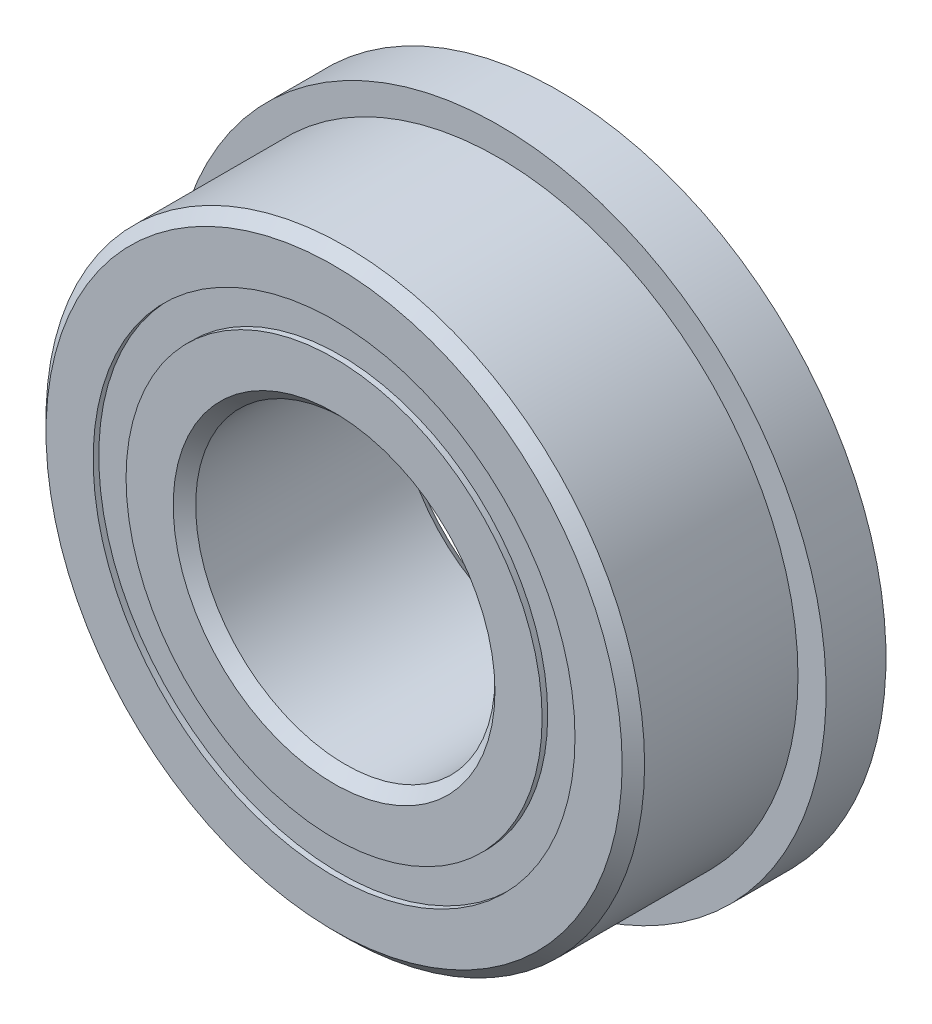
ISO-10303-21;
HEADER;
FILE_DESCRIPTION(('STEP AP214'),'2;1');
FILE_NAME('part.step','',(''),(''),'','','');
FILE_SCHEMA(('AUTOMOTIVE_DESIGN { 1 0 10303 214 1 1 1 1 }'));
ENDSEC;
DATA;
#1=APPLICATION_CONTEXT('core data for automotive mechanical design processes');
#2=APPLICATION_PROTOCOL_DEFINITION('international standard','automotive_design',2000,#1);
#3=PRODUCT_CONTEXT('',#1,'mechanical');
#4=PRODUCT('Part','Part','',(#3));
#5=PRODUCT_RELATED_PRODUCT_CATEGORY('part','',(#4));
#6=PRODUCT_DEFINITION_FORMATION('','',#4);
#7=PRODUCT_DEFINITION_CONTEXT('part definition',#1,'design');
#8=PRODUCT_DEFINITION('design','',#6,#7);
#9=PRODUCT_DEFINITION_SHAPE('','',#8);
#10=(LENGTH_UNIT() NAMED_UNIT(*) SI_UNIT(.MILLI.,.METRE.));
#11=(NAMED_UNIT(*) PLANE_ANGLE_UNIT() SI_UNIT($,.RADIAN.));
#12=(NAMED_UNIT(*) SI_UNIT($,.STERADIAN.) SOLID_ANGLE_UNIT());
#13=UNCERTAINTY_MEASURE_WITH_UNIT(LENGTH_MEASURE(1.E-05),#10,'distance_accuracy_value','');
#14=(GEOMETRIC_REPRESENTATION_CONTEXT(3) GLOBAL_UNCERTAINTY_ASSIGNED_CONTEXT((#13)) GLOBAL_UNIT_ASSIGNED_CONTEXT((#10,
#11,#12)) REPRESENTATION_CONTEXT('',''));
#15=CARTESIAN_POINT('',(0.,0.,0.));
#16=DIRECTION('',(0.,0.,1.));
#17=DIRECTION('',(1.,0.,0.));
#18=AXIS2_PLACEMENT_3D('',#15,#16,#17);
#19=CARTESIAN_POINT('',(0.,5.1114010989011,-2.2621875));
#20=DIRECTION('',(0.,0.,1.));
#21=DIRECTION('',(1.,0.,0.));
#22=AXIS2_PLACEMENT_3D('',#19,#20,#21);
#23=PLANE('',#22);
#24=CARTESIAN_POINT('',(0.,0.,-2.2621875));
#25=DIRECTION('',(0.,0.,1.));
#26=DIRECTION('',(1.,0.,0.));
#27=AXIS2_PLACEMENT_3D('',#24,#25,#26);
#28=CIRCLE('',#27,5.1114010989011);
#29=CARTESIAN_POINT('',(5.1114010989011,0.,-2.2621875));
#30=VERTEX_POINT('',#29);
#31=EDGE_CURVE('E70',#30,#30,#28,.T.);
#32=ORIENTED_EDGE('',*,*,#31,.F.);
#33=EDGE_LOOP('',(#32));
#34=FACE_BOUND('',#33,.T.);
#35=CARTESIAN_POINT('',(0.,0.,-2.2621875));
#36=DIRECTION('',(0.,0.,1.));
#37=DIRECTION('',(1.,0.,0.));
#38=AXIS2_PLACEMENT_3D('',#35,#36,#37);
#39=CIRCLE('',#38,4.4135989010989);
#40=CARTESIAN_POINT('',(4.4135989010989,0.,-2.2621875));
#41=VERTEX_POINT('',#40);
#42=EDGE_CURVE('E11',#41,#41,#39,.T.);
#43=ORIENTED_EDGE('',*,*,#42,.T.);
#44=EDGE_LOOP('',(#43));
#45=FACE_BOUND('',#44,.T.);
#46=ADVANCED_FACE('F56',(#34,#45),#23,.F.);
#47=CARTESIAN_POINT('',(0.,0.,2.38125));
#48=DIRECTION('',(0.,0.,1.));
#49=DIRECTION('',(1.,0.,0.));
#50=AXIS2_PLACEMENT_3D('',#47,#48,#49);
#51=CYLINDRICAL_SURFACE('',#50,4.4135989010989);
#52=ORIENTED_EDGE('',*,*,#42,.F.);
#53=EDGE_LOOP('',(#52));
#54=FACE_BOUND('',#53,.T.);
#55=CARTESIAN_POINT('',(0.,0.,-1.11436144103197));
#56=DIRECTION('',(0.,0.,1.));
#57=DIRECTION('',(1.,0.,0.));
#58=AXIS2_PLACEMENT_3D('',#55,#56,#57);
#59=CIRCLE('',#58,4.4135989010989);
#60=CARTESIAN_POINT('',(4.4135989010989,0.,-1.11436144103197));
#61=VERTEX_POINT('',#60);
#62=EDGE_CURVE('E62',#61,#61,#59,.T.);
#63=ORIENTED_EDGE('',*,*,#62,.T.);
#64=EDGE_LOOP('',(#63));
#65=FACE_BOUND('',#64,.T.);
#66=ADVANCED_FACE('F79',(#54,#65),#51,.F.);
#67=CARTESIAN_POINT('',(0.,5.1114010989011,-1.11436144103197));
#68=DIRECTION('',(0.,0.,-1.));
#69=DIRECTION('',(-1.,0.,0.));
#70=AXIS2_PLACEMENT_3D('',#67,#68,#69);
#71=PLANE('',#70);
#72=ORIENTED_EDGE('',*,*,#62,.F.);
#73=EDGE_LOOP('',(#72));
#74=FACE_BOUND('',#73,.T.);
#75=CARTESIAN_POINT('',(0.,0.,-1.11436144103197));
#76=DIRECTION('',(0.,0.,1.));
#77=DIRECTION('',(1.,0.,0.));
#78=AXIS2_PLACEMENT_3D('',#75,#76,#77);
#79=CIRCLE('',#78,5.1114010989011);
#80=CARTESIAN_POINT('',(5.1114010989011,0.,-1.11436144103197));
#81=VERTEX_POINT('',#80);
#82=EDGE_CURVE('E66',#81,#81,#79,.T.);
#83=ORIENTED_EDGE('',*,*,#82,.T.);
#84=EDGE_LOOP('',(#83));
#85=FACE_BOUND('',#84,.T.);
#86=ADVANCED_FACE('F83',(#74,#85),#71,.F.);
#87=CARTESIAN_POINT('',(0.,0.,2.38125));
#88=DIRECTION('',(0.,0.,1.));
#89=DIRECTION('',(1.,0.,0.));
#90=AXIS2_PLACEMENT_3D('',#87,#88,#89);
#91=CYLINDRICAL_SURFACE('',#90,5.1114010989011);
#92=ORIENTED_EDGE('',*,*,#82,.F.);
#93=EDGE_LOOP('',(#92));
#94=FACE_BOUND('',#93,.T.);
#95=ORIENTED_EDGE('',*,*,#31,.T.);
#96=EDGE_LOOP('',(#95));
#97=FACE_BOUND('',#96,.T.);
#98=ADVANCED_FACE('F76',(#94,#97),#91,.T.);
#99=CLOSED_SHELL('',(#46,#66,#86,#98));
#100=MANIFOLD_SOLID_BREP('B2',#99);
#101=CARTESIAN_POINT('',(0.,5.1114010989011,2.2621875));
#102=DIRECTION('',(0.,0.,-1.));
#103=DIRECTION('',(-1.,0.,0.));
#104=AXIS2_PLACEMENT_3D('',#101,#102,#103);
#105=PLANE('',#104);
#106=CARTESIAN_POINT('',(0.,0.,2.2621875));
#107=DIRECTION('',(0.,0.,1.));
#108=DIRECTION('',(1.,0.,0.));
#109=AXIS2_PLACEMENT_3D('',#106,#107,#108);
#110=CIRCLE('',#109,4.4135989010989);
#111=CARTESIAN_POINT('',(4.4135989010989,0.,2.2621875));
#112=VERTEX_POINT('',#111);
#113=EDGE_CURVE('E55',#112,#112,#110,.T.);
#114=ORIENTED_EDGE('',*,*,#113,.F.);
#115=EDGE_LOOP('',(#114));
#116=FACE_BOUND('',#115,.T.);
#117=CARTESIAN_POINT('',(0.,0.,2.2621875));
#118=DIRECTION('',(0.,0.,1.));
#119=DIRECTION('',(1.,0.,0.));
#120=AXIS2_PLACEMENT_3D('',#117,#118,#119);
#121=CIRCLE('',#120,5.1114010989011);
#122=CARTESIAN_POINT('',(5.1114010989011,0.,2.2621875));
#123=VERTEX_POINT('',#122);
#124=EDGE_CURVE('E130',#123,#123,#121,.T.);
#125=ORIENTED_EDGE('',*,*,#124,.T.);
#126=EDGE_LOOP('',(#125));
#127=FACE_BOUND('',#126,.T.);
#128=ADVANCED_FACE('F116',(#116,#127),#105,.F.);
#129=CARTESIAN_POINT('',(0.,0.,2.38125));
#130=DIRECTION('',(0.,0.,1.));
#131=DIRECTION('',(1.,0.,0.));
#132=AXIS2_PLACEMENT_3D('',#129,#130,#131);
#133=CYLINDRICAL_SURFACE('',#132,4.4135989010989);
#134=CARTESIAN_POINT('',(0.,0.,1.11436144103197));
#135=DIRECTION('',(0.,0.,1.));
#136=DIRECTION('',(1.,0.,0.));
#137=AXIS2_PLACEMENT_3D('',#134,#135,#136);
#138=CIRCLE('',#137,4.4135989010989);
#139=CARTESIAN_POINT('',(4.4135989010989,0.,1.11436144103197));
#140=VERTEX_POINT('',#139);
#141=EDGE_CURVE('E122',#140,#140,#138,.T.);
#142=ORIENTED_EDGE('',*,*,#141,.F.);
#143=EDGE_LOOP('',(#142));
#144=FACE_BOUND('',#143,.T.);
#145=ORIENTED_EDGE('',*,*,#113,.T.);
#146=EDGE_LOOP('',(#145));
#147=FACE_BOUND('',#146,.T.);
#148=ADVANCED_FACE('F145',(#144,#147),#133,.F.);
#149=CARTESIAN_POINT('',(0.,5.1114010989011,1.11436144103197));
#150=DIRECTION('',(0.,0.,1.));
#151=DIRECTION('',(1.,0.,0.));
#152=AXIS2_PLACEMENT_3D('',#149,#150,#151);
#153=PLANE('',#152);
#154=CARTESIAN_POINT('',(0.,0.,1.11436144103197));
#155=DIRECTION('',(0.,0.,1.));
#156=DIRECTION('',(1.,0.,0.));
#157=AXIS2_PLACEMENT_3D('',#154,#155,#156);
#158=CIRCLE('',#157,5.1114010989011);
#159=CARTESIAN_POINT('',(5.1114010989011,0.,1.11436144103197));
#160=VERTEX_POINT('',#159);
#161=EDGE_CURVE('E126',#160,#160,#158,.T.);
#162=ORIENTED_EDGE('',*,*,#161,.F.);
#163=EDGE_LOOP('',(#162));
#164=FACE_BOUND('',#163,.T.);
#165=ORIENTED_EDGE('',*,*,#141,.T.);
#166=EDGE_LOOP('',(#165));
#167=FACE_BOUND('',#166,.T.);
#168=ADVANCED_FACE('F140',(#164,#167),#153,.F.);
#169=CARTESIAN_POINT('',(0.,0.,2.38125));
#170=DIRECTION('',(0.,0.,1.));
#171=DIRECTION('',(1.,0.,0.));
#172=AXIS2_PLACEMENT_3D('',#169,#170,#171);
#173=CYLINDRICAL_SURFACE('',#172,5.1114010989011);
#174=ORIENTED_EDGE('',*,*,#124,.F.);
#175=EDGE_LOOP('',(#174));
#176=FACE_BOUND('',#175,.T.);
#177=ORIENTED_EDGE('',*,*,#161,.T.);
#178=EDGE_LOOP('',(#177));
#179=FACE_BOUND('',#178,.T.);
#180=ADVANCED_FACE('F137',(#176,#179),#173,.T.);
#181=CLOSED_SHELL('',(#128,#148,#168,#180));
#182=MANIFOLD_SOLID_BREP('B6',#181);
#183=CARTESIAN_POINT('',(-2.38124999999995,4.12444598552342,0.));
#184=DIRECTION('',(0.,0.,1.));
#185=DIRECTION('',(-0.499999999999989,0.866025403784445,0.));
#186=AXIS2_PLACEMENT_3D('',#183,#184,#185);
#187=SPHERICAL_SURFACE('',#186,1.11436144103197);
#188=CARTESIAN_POINT('',(-2.38124999999995,4.12444598552342,1.11436144103197));
#189=VERTEX_POINT('',#188);
#190=VERTEX_LOOP('',#189);
#191=FACE_BOUND('',#190,.T.);
#192=ADVANCED_FACE('F176',(#191),#187,.T.);
#193=CLOSED_SHELL('',(#192));
#194=MANIFOLD_SOLID_BREP('B50',#193);
#195=CARTESIAN_POINT('',(-4.12444598552336,2.38125000000005,0.));
#196=DIRECTION('',(0.,0.,1.));
#197=DIRECTION('',(-0.866025403784433,0.50000000000001,0.));
#198=AXIS2_PLACEMENT_3D('',#195,#196,#197);
#199=SPHERICAL_SURFACE('',#198,1.11436144103197);
#200=CARTESIAN_POINT('',(-4.12444598552336,2.38125000000005,1.11436144103197));
#201=VERTEX_POINT('',#200);
#202=VERTEX_LOOP('',#201);
#203=FACE_BOUND('',#202,.T.);
#204=ADVANCED_FACE('F199',(#203),#199,.T.);
#205=CLOSED_SHELL('',(#204));
#206=MANIFOLD_SOLID_BREP('B112',#205);
#207=CARTESIAN_POINT('',(-4.7625,0.,0.));
#208=DIRECTION('',(0.,0.,1.));
#209=DIRECTION('',(-1.,0.,0.));
#210=AXIS2_PLACEMENT_3D('',#207,#208,#209);
#211=SPHERICAL_SURFACE('',#210,1.11436144103197);
#212=CARTESIAN_POINT('',(-4.7625,0.,1.11436144103197));
#213=VERTEX_POINT('',#212);
#214=VERTEX_LOOP('',#213);
#215=FACE_BOUND('',#214,.T.);
#216=ADVANCED_FACE('F222',(#215),#211,.T.);
#217=CLOSED_SHELL('',(#216));
#218=MANIFOLD_SOLID_BREP('B172',#217);
#219=CARTESIAN_POINT('',(-4.12444598552341,-2.38124999999996,0.));
#220=DIRECTION('',(0.,0.,1.));
#221=DIRECTION('',(-0.866025403784443,-0.499999999999992,0.));
#222=AXIS2_PLACEMENT_3D('',#219,#220,#221);
#223=SPHERICAL_SURFACE('',#222,1.11436144103197);
#224=CARTESIAN_POINT('',(-4.12444598552341,-2.38124999999996,1.11436144103197));
#225=VERTEX_POINT('',#224);
#226=VERTEX_LOOP('',#225);
#227=FACE_BOUND('',#226,.T.);
#228=ADVANCED_FACE('F245',(#227),#223,.T.);
#229=CLOSED_SHELL('',(#228));
#230=MANIFOLD_SOLID_BREP('B195',#229);
#231=CARTESIAN_POINT('',(-2.38125000000003,-4.12444598552337,0.));
#232=DIRECTION('',(0.,0.,1.));
#233=DIRECTION('',(-0.500000000000007,-0.866025403784435,0.));
#234=AXIS2_PLACEMENT_3D('',#231,#232,#233);
#235=SPHERICAL_SURFACE('',#234,1.11436144103197);
#236=CARTESIAN_POINT('',(-2.38125000000003,-4.12444598552337,1.11436144103197));
#237=VERTEX_POINT('',#236);
#238=VERTEX_LOOP('',#237);
#239=FACE_BOUND('',#238,.T.);
#240=ADVANCED_FACE('F268',(#239),#235,.T.);
#241=CLOSED_SHELL('',(#240));
#242=MANIFOLD_SOLID_BREP('B218',#241);
#243=CARTESIAN_POINT('',(0.,-4.7625,0.));
#244=DIRECTION('',(0.,0.,1.));
#245=DIRECTION('',(0.,-1.,0.));
#246=AXIS2_PLACEMENT_3D('',#243,#244,#245);
#247=SPHERICAL_SURFACE('',#246,1.11436144103197);
#248=CARTESIAN_POINT('',(0.,-4.7625,1.11436144103197));
#249=VERTEX_POINT('',#248);
#250=VERTEX_LOOP('',#249);
#251=FACE_BOUND('',#250,.T.);
#252=ADVANCED_FACE('F291',(#251),#247,.T.);
#253=CLOSED_SHELL('',(#252));
#254=MANIFOLD_SOLID_BREP('B241',#253);
#255=CARTESIAN_POINT('',(2.38124999999998,-4.1244459855234,0.));
#256=DIRECTION('',(0.,0.,1.));
#257=DIRECTION('',(0.499999999999995,-0.866025403784442,0.));
#258=AXIS2_PLACEMENT_3D('',#255,#256,#257);
#259=SPHERICAL_SURFACE('',#258,1.11436144103197);
#260=CARTESIAN_POINT('',(2.38124999999998,-4.1244459855234,1.11436144103197));
#261=VERTEX_POINT('',#260);
#262=VERTEX_LOOP('',#261);
#263=FACE_BOUND('',#262,.T.);
#264=ADVANCED_FACE('F314',(#263),#259,.T.);
#265=CLOSED_SHELL('',(#264));
#266=MANIFOLD_SOLID_BREP('B264',#265);
#267=CARTESIAN_POINT('',(4.12444598552338,-2.38125000000002,0.));
#268=DIRECTION('',(0.,0.,1.));
#269=DIRECTION('',(0.866025403784436,-0.500000000000004,0.));
#270=AXIS2_PLACEMENT_3D('',#267,#268,#269);
#271=SPHERICAL_SURFACE('',#270,1.11436144103197);
#272=CARTESIAN_POINT('',(4.12444598552338,-2.38125000000002,1.11436144103197));
#273=VERTEX_POINT('',#272);
#274=VERTEX_LOOP('',#273);
#275=FACE_BOUND('',#274,.T.);
#276=ADVANCED_FACE('F337',(#275),#271,.T.);
#277=CLOSED_SHELL('',(#276));
#278=MANIFOLD_SOLID_BREP('B287',#277);
#279=CARTESIAN_POINT('',(4.7625,0.,0.));
#280=DIRECTION('',(0.,0.,1.));
#281=DIRECTION('',(1.,0.,0.));
#282=AXIS2_PLACEMENT_3D('',#279,#280,#281);
#283=SPHERICAL_SURFACE('',#282,1.11436144103197);
#284=CARTESIAN_POINT('',(4.7625,0.,1.11436144103197));
#285=VERTEX_POINT('',#284);
#286=VERTEX_LOOP('',#285);
#287=FACE_BOUND('',#286,.T.);
#288=ADVANCED_FACE('F360',(#287),#283,.T.);
#289=CLOSED_SHELL('',(#288));
#290=MANIFOLD_SOLID_BREP('B310',#289);
#291=CARTESIAN_POINT('',(4.12444598552339,2.38124999999999,0.));
#292=DIRECTION('',(0.,0.,1.));
#293=DIRECTION('',(0.86602540378444,0.499999999999998,0.));
#294=AXIS2_PLACEMENT_3D('',#291,#292,#293);
#295=SPHERICAL_SURFACE('',#294,1.11436144103197);
#296=CARTESIAN_POINT('',(4.12444598552339,2.38124999999999,1.11436144103197));
#297=VERTEX_POINT('',#296);
#298=VERTEX_LOOP('',#297);
#299=FACE_BOUND('',#298,.T.);
#300=ADVANCED_FACE('F383',(#299),#295,.T.);
#301=CLOSED_SHELL('',(#300));
#302=MANIFOLD_SOLID_BREP('B333',#301);
#303=CARTESIAN_POINT('',(2.38125,4.12444598552339,0.));
#304=DIRECTION('',(0.,0.,1.));
#305=DIRECTION('',(0.500000000000001,0.866025403784438,0.));
#306=AXIS2_PLACEMENT_3D('',#303,#304,#305);
#307=SPHERICAL_SURFACE('',#306,1.11436144103197);
#308=CARTESIAN_POINT('',(2.38125,4.12444598552339,1.11436144103197));
#309=VERTEX_POINT('',#308);
#310=VERTEX_LOOP('',#309);
#311=FACE_BOUND('',#310,.T.);
#312=ADVANCED_FACE('F406',(#311),#307,.T.);
#313=CLOSED_SHELL('',(#312));
#314=MANIFOLD_SOLID_BREP('B356',#313);
#315=CARTESIAN_POINT('',(0.,4.7625,0.));
#316=DIRECTION('',(0.,0.,1.));
#317=DIRECTION('',(0.,1.,0.));
#318=AXIS2_PLACEMENT_3D('',#315,#316,#317);
#319=SPHERICAL_SURFACE('',#318,1.11436144103197);
#320=CARTESIAN_POINT('',(0.,4.7625,1.11436144103197));
#321=VERTEX_POINT('',#320);
#322=VERTEX_LOOP('',#321);
#323=FACE_BOUND('',#322,.T.);
#324=ADVANCED_FACE('F431',(#323),#319,.T.);
#325=CLOSED_SHELL('',(#324));
#326=MANIFOLD_SOLID_BREP('B379',#325);
#327=CARTESIAN_POINT('',(0.,4.4135989010989,2.38125));
#328=DIRECTION('',(0.,0.,-1.));
#329=DIRECTION('',(-1.,0.,0.));
#330=AXIS2_PLACEMENT_3D('',#327,#328,#329);
#331=PLANE('',#330);
#332=CARTESIAN_POINT('',(0.,0.,2.38125));
#333=DIRECTION('',(0.,0.,1.));
#334=DIRECTION('',(1.,0.,0.));
#335=AXIS2_PLACEMENT_3D('',#332,#333,#334);
#336=CIRCLE('',#335,3.413125);
#337=CARTESIAN_POINT('',(3.413125,0.,2.38125));
#338=VERTEX_POINT('',#337);
#339=EDGE_CURVE('E477',#338,#338,#336,.T.);
#340=ORIENTED_EDGE('',*,*,#339,.F.);
#341=EDGE_LOOP('',(#340));
#342=FACE_BOUND('',#341,.T.);
#343=CARTESIAN_POINT('',(0.,0.,2.38125));
#344=DIRECTION('',(0.,0.,1.));
#345=DIRECTION('',(1.,0.,0.));
#346=AXIS2_PLACEMENT_3D('',#343,#344,#345);
#347=CIRCLE('',#346,4.4135989010989);
#348=CARTESIAN_POINT('',(4.4135989010989,0.,2.38125));
#349=VERTEX_POINT('',#348);
#350=EDGE_CURVE('E430',#349,#349,#347,.T.);
#351=ORIENTED_EDGE('',*,*,#350,.T.);
#352=EDGE_LOOP('',(#351));
#353=FACE_BOUND('',#352,.T.);
#354=ADVANCED_FACE('F449',(#342,#353),#331,.F.);
#355=CARTESIAN_POINT('',(0.,0.,2.38125));
#356=DIRECTION('',(0.,0.,1.));
#357=DIRECTION('',(1.,0.,0.));
#358=AXIS2_PLACEMENT_3D('',#355,#356,#357);
#359=CYLINDRICAL_SURFACE('',#358,4.4135989010989);
#360=ORIENTED_EDGE('',*,*,#350,.F.);
#361=EDGE_LOOP('',(#360));
#362=FACE_BOUND('',#361,.T.);
#363=CARTESIAN_POINT('',(0.,0.,1.05833333333333));
#364=DIRECTION('',(0.,0.,1.));
#365=DIRECTION('',(1.,0.,0.));
#366=AXIS2_PLACEMENT_3D('',#363,#364,#365);
#367=CIRCLE('',#366,4.4135989010989);
#368=CARTESIAN_POINT('',(4.4135989010989,0.,1.05833333333333));
#369=VERTEX_POINT('',#368);
#370=EDGE_CURVE('E455',#369,#369,#367,.T.);
#371=ORIENTED_EDGE('',*,*,#370,.T.);
#372=EDGE_LOOP('',(#371));
#373=FACE_BOUND('',#372,.T.);
#374=ADVANCED_FACE('F484',(#362,#373),#359,.T.);
#375=CARTESIAN_POINT('',(0.,0.,0.));
#376=DIRECTION('',(0.,0.,1.));
#377=DIRECTION('',(1.,0.,0.));
#378=AXIS2_PLACEMENT_3D('',#375,#376,#377);
#379=TOROIDAL_SURFACE('',#378,4.76249999999999,1.11436144103196);
#380=ORIENTED_EDGE('',*,*,#370,.F.);
#381=EDGE_LOOP('',(#380));
#382=FACE_BOUND('',#381,.T.);
#383=CARTESIAN_POINT('',(0.,0.,-1.05833333333333));
#384=DIRECTION('',(0.,0.,1.));
#385=DIRECTION('',(1.,0.,0.));
#386=AXIS2_PLACEMENT_3D('',#383,#384,#385);
#387=CIRCLE('',#386,4.4135989010989);
#388=CARTESIAN_POINT('',(4.4135989010989,0.,-1.05833333333333));
#389=VERTEX_POINT('',#388);
#390=EDGE_CURVE('E459',#389,#389,#387,.T.);
#391=ORIENTED_EDGE('',*,*,#390,.T.);
#392=EDGE_LOOP('',(#391));
#393=FACE_BOUND('',#392,.T.);
#394=ADVANCED_FACE('F488',(#382,#393),#379,.F.);
#395=CARTESIAN_POINT('',(0.,0.,2.38125));
#396=DIRECTION('',(0.,0.,1.));
#397=DIRECTION('',(1.,0.,0.));
#398=AXIS2_PLACEMENT_3D('',#395,#396,#397);
#399=CYLINDRICAL_SURFACE('',#398,4.4135989010989);
#400=ORIENTED_EDGE('',*,*,#390,.F.);
#401=EDGE_LOOP('',(#400));
#402=FACE_BOUND('',#401,.T.);
#403=CARTESIAN_POINT('',(0.,0.,-2.38125));
#404=DIRECTION('',(0.,0.,1.));
#405=DIRECTION('',(1.,0.,0.));
#406=AXIS2_PLACEMENT_3D('',#403,#404,#405);
#407=CIRCLE('',#406,4.4135989010989);
#408=CARTESIAN_POINT('',(4.4135989010989,0.,-2.38125));
#409=VERTEX_POINT('',#408);
#410=EDGE_CURVE('E463',#409,#409,#407,.T.);
#411=ORIENTED_EDGE('',*,*,#410,.T.);
#412=EDGE_LOOP('',(#411));
#413=FACE_BOUND('',#412,.T.);
#414=ADVANCED_FACE('F493',(#402,#413),#399,.T.);
#415=CARTESIAN_POINT('',(0.,3.413125,-2.38125));
#416=DIRECTION('',(0.,0.,1.));
#417=DIRECTION('',(1.,0.,0.));
#418=AXIS2_PLACEMENT_3D('',#415,#416,#417);
#419=PLANE('',#418);
#420=ORIENTED_EDGE('',*,*,#410,.F.);
#421=EDGE_LOOP('',(#420));
#422=FACE_BOUND('',#421,.T.);
#423=CARTESIAN_POINT('',(0.,0.,-2.38125));
#424=DIRECTION('',(0.,0.,1.));
#425=DIRECTION('',(1.,0.,0.));
#426=AXIS2_PLACEMENT_3D('',#423,#424,#425);
#427=CIRCLE('',#426,3.413125);
#428=CARTESIAN_POINT('',(3.413125,0.,-2.38125));
#429=VERTEX_POINT('',#428);
#430=EDGE_CURVE('E468',#429,#429,#427,.T.);
#431=ORIENTED_EDGE('',*,*,#430,.T.);
#432=EDGE_LOOP('',(#431));
#433=FACE_BOUND('',#432,.T.);
#434=ADVANCED_FACE('F499',(#422,#433),#419,.F.);
#435=CARTESIAN_POINT('',(0.,0.,-2.143125));
#436=DIRECTION('',(0.,0.,-1.));
#437=DIRECTION('',(-1.,0.,0.));
#438=AXIS2_PLACEMENT_3D('',#435,#436,#437);
#439=CONICAL_SURFACE('',#438,3.175,0.785398163397447);
#440=ORIENTED_EDGE('',*,*,#430,.F.);
#441=EDGE_LOOP('',(#440));
#442=FACE_BOUND('',#441,.T.);
#443=CARTESIAN_POINT('',(0.,0.,-2.143125));
#444=DIRECTION('',(0.,0.,1.));
#445=DIRECTION('',(1.,0.,0.));
#446=AXIS2_PLACEMENT_3D('',#443,#444,#445);
#447=CIRCLE('',#446,3.175);
#448=CARTESIAN_POINT('',(3.175,0.,-2.143125));
#449=VERTEX_POINT('',#448);
#450=EDGE_CURVE('E471',#449,#449,#447,.T.);
#451=ORIENTED_EDGE('',*,*,#450,.T.);
#452=EDGE_LOOP('',(#451));
#453=FACE_BOUND('',#452,.T.);
#454=ADVANCED_FACE('F503',(#442,#453),#439,.F.);
#455=CARTESIAN_POINT('',(0.,0.,2.38125));
#456=DIRECTION('',(0.,0.,1.));
#457=DIRECTION('',(1.,0.,0.));
#458=AXIS2_PLACEMENT_3D('',#455,#456,#457);
#459=CYLINDRICAL_SURFACE('',#458,3.175);
#460=ORIENTED_EDGE('',*,*,#450,.F.);
#461=EDGE_LOOP('',(#460));
#462=FACE_BOUND('',#461,.T.);
#463=CARTESIAN_POINT('',(0.,0.,2.143125));
#464=DIRECTION('',(0.,0.,1.));
#465=DIRECTION('',(1.,0.,0.));
#466=AXIS2_PLACEMENT_3D('',#463,#464,#465);
#467=CIRCLE('',#466,3.175);
#468=CARTESIAN_POINT('',(3.175,0.,2.143125));
#469=VERTEX_POINT('',#468);
#470=EDGE_CURVE('E474',#469,#469,#467,.T.);
#471=ORIENTED_EDGE('',*,*,#470,.T.);
#472=EDGE_LOOP('',(#471));
#473=FACE_BOUND('',#472,.T.);
#474=ADVANCED_FACE('F507',(#462,#473),#459,.F.);
#475=CARTESIAN_POINT('',(0.,0.,2.38125));
#476=DIRECTION('',(0.,0.,1.));
#477=DIRECTION('',(1.,0.,0.));
#478=AXIS2_PLACEMENT_3D('',#475,#476,#477);
#479=CONICAL_SURFACE('',#478,3.413125,0.785398163397448);
#480=ORIENTED_EDGE('',*,*,#470,.F.);
#481=EDGE_LOOP('',(#480));
#482=FACE_BOUND('',#481,.T.);
#483=ORIENTED_EDGE('',*,*,#339,.T.);
#484=EDGE_LOOP('',(#483));
#485=FACE_BOUND('',#484,.T.);
#486=ADVANCED_FACE('F481',(#482,#485),#479,.F.);
#487=CLOSED_SHELL('',(#354,#374,#394,#414,#434,#454,#474,#486));
#488=MANIFOLD_SOLID_BREP('B402',#487);
#489=CARTESIAN_POINT('',(0.,0.,2.143125));
#490=DIRECTION('',(0.,0.,-1.));
#491=DIRECTION('',(-1.,0.,0.));
#492=AXIS2_PLACEMENT_3D('',#489,#490,#491);
#493=CONICAL_SURFACE('',#492,6.35,0.785398163397449);
#494=CARTESIAN_POINT('',(0.,0.,2.38125));
#495=DIRECTION('',(0.,0.,1.));
#496=DIRECTION('',(1.,0.,0.));
#497=AXIS2_PLACEMENT_3D('',#494,#495,#496);
#498=CIRCLE('',#497,6.111875);
#499=CARTESIAN_POINT('',(6.111875,0.,2.38125));
#500=VERTEX_POINT('',#499);
#501=EDGE_CURVE('E582',#500,#500,#498,.T.);
#502=ORIENTED_EDGE('',*,*,#501,.F.);
#503=EDGE_LOOP('',(#502));
#504=FACE_BOUND('',#503,.T.);
#505=CARTESIAN_POINT('',(0.,0.,2.143125));
#506=DIRECTION('',(0.,0.,1.));
#507=DIRECTION('',(1.,0.,0.));
#508=AXIS2_PLACEMENT_3D('',#505,#506,#507);
#509=CIRCLE('',#508,6.35);
#510=CARTESIAN_POINT('',(6.35,0.,2.143125));
#511=VERTEX_POINT('',#510);
#512=EDGE_CURVE('E448',#511,#511,#509,.T.);
#513=ORIENTED_EDGE('',*,*,#512,.T.);
#514=EDGE_LOOP('',(#513));
#515=FACE_BOUND('',#514,.T.);
#516=ADVANCED_FACE('F555',(#504,#515),#493,.T.);
#517=CARTESIAN_POINT('',(0.,0.,2.38125));
#518=DIRECTION('',(0.,0.,1.));
#519=DIRECTION('',(1.,0.,0.));
#520=AXIS2_PLACEMENT_3D('',#517,#518,#519);
#521=CYLINDRICAL_SURFACE('',#520,6.35);
#522=CARTESIAN_POINT('',(0.,0.,-1.11125));
#523=DIRECTION('',(0.,0.,1.));
#524=DIRECTION('',(1.,0.,0.));
#525=AXIS2_PLACEMENT_3D('',#522,#523,#524);
#526=CIRCLE('',#525,6.35);
#527=CARTESIAN_POINT('',(6.35,0.,-1.11125));
#528=VERTEX_POINT('',#527);
#529=EDGE_CURVE('E586',#528,#528,#526,.T.);
#530=ORIENTED_EDGE('',*,*,#529,.T.);
#531=EDGE_LOOP('',(#530));
#532=FACE_BOUND('',#531,.T.);
#533=ORIENTED_EDGE('',*,*,#512,.F.);
#534=EDGE_LOOP('',(#533));
#535=FACE_BOUND('',#534,.T.);
#536=ADVANCED_FACE('F609',(#532,#535),#521,.T.);
#537=CARTESIAN_POINT('',(0.,6.111875,-2.38125));
#538=DIRECTION('',(0.,0.,1.));
#539=DIRECTION('',(1.,0.,0.));
#540=AXIS2_PLACEMENT_3D('',#537,#538,#539);
#541=PLANE('',#540);
#542=CARTESIAN_POINT('',(0.,0.,-2.38125));
#543=DIRECTION('',(0.,0.,1.));
#544=DIRECTION('',(1.,0.,0.));
#545=AXIS2_PLACEMENT_3D('',#542,#543,#544);
#546=CIRCLE('',#545,5.1114010989011);
#547=CARTESIAN_POINT('',(5.1114010989011,0.,-2.38125));
#548=VERTEX_POINT('',#547);
#549=EDGE_CURVE('E562',#548,#548,#546,.T.);
#550=ORIENTED_EDGE('',*,*,#549,.T.);
#551=EDGE_LOOP('',(#550));
#552=FACE_BOUND('',#551,.T.);
#553=CARTESIAN_POINT('',(0.,0.,-2.38125));
#554=DIRECTION('',(0.,0.,-1.));
#555=DIRECTION('',(-1.,0.,0.));
#556=AXIS2_PLACEMENT_3D('',#553,#554,#555);
#557=CIRCLE('',#556,6.9469);
#558=CARTESIAN_POINT('',(-6.9469,0.,-2.38125));
#559=VERTEX_POINT('',#558);
#560=EDGE_CURVE('E590',#559,#559,#557,.T.);
#561=ORIENTED_EDGE('',*,*,#560,.T.);
#562=EDGE_LOOP('',(#561));
#563=FACE_BOUND('',#562,.T.);
#564=ADVANCED_FACE('F612',(#552,#563),#541,.F.);
#565=CARTESIAN_POINT('',(0.,0.,2.38125));
#566=DIRECTION('',(0.,0.,1.));
#567=DIRECTION('',(1.,0.,0.));
#568=AXIS2_PLACEMENT_3D('',#565,#566,#567);
#569=CYLINDRICAL_SURFACE('',#568,5.1114010989011);
#570=CARTESIAN_POINT('',(0.,0.,-1.05833333333333));
#571=DIRECTION('',(0.,0.,1.));
#572=DIRECTION('',(1.,0.,0.));
#573=AXIS2_PLACEMENT_3D('',#570,#571,#572);
#574=CIRCLE('',#573,5.1114010989011);
#575=CARTESIAN_POINT('',(5.1114010989011,0.,-1.05833333333333));
#576=VERTEX_POINT('',#575);
#577=EDGE_CURVE('E567',#576,#576,#574,.T.);
#578=ORIENTED_EDGE('',*,*,#577,.T.);
#579=EDGE_LOOP('',(#578));
#580=FACE_BOUND('',#579,.T.);
#581=ORIENTED_EDGE('',*,*,#549,.F.);
#582=EDGE_LOOP('',(#581));
#583=FACE_BOUND('',#582,.T.);
#584=ADVANCED_FACE('F617',(#580,#583),#569,.F.);
#585=CARTESIAN_POINT('',(0.,0.,0.));
#586=DIRECTION('',(0.,0.,1.));
#587=DIRECTION('',(1.,0.,0.));
#588=AXIS2_PLACEMENT_3D('',#585,#586,#587);
#589=TOROIDAL_SURFACE('',#588,4.7625,1.11436144103197);
#590=ORIENTED_EDGE('',*,*,#577,.F.);
#591=EDGE_LOOP('',(#590));
#592=FACE_BOUND('',#591,.T.);
#593=CARTESIAN_POINT('',(0.,0.,1.05833333333333));
#594=DIRECTION('',(0.,0.,1.));
#595=DIRECTION('',(1.,0.,0.));
#596=AXIS2_PLACEMENT_3D('',#593,#594,#595);
#597=CIRCLE('',#596,5.1114010989011);
#598=CARTESIAN_POINT('',(5.1114010989011,0.,1.05833333333333));
#599=VERTEX_POINT('',#598);
#600=EDGE_CURVE('E572',#599,#599,#597,.T.);
#601=ORIENTED_EDGE('',*,*,#600,.T.);
#602=EDGE_LOOP('',(#601));
#603=FACE_BOUND('',#602,.T.);
#604=ADVANCED_FACE('F624',(#592,#603),#589,.F.);
#605=CARTESIAN_POINT('',(0.,0.,2.38125));
#606=DIRECTION('',(0.,0.,1.));
#607=DIRECTION('',(1.,0.,0.));
#608=AXIS2_PLACEMENT_3D('',#605,#606,#607);
#609=CYLINDRICAL_SURFACE('',#608,5.1114010989011);
#610=ORIENTED_EDGE('',*,*,#600,.F.);
#611=EDGE_LOOP('',(#610));
#612=FACE_BOUND('',#611,.T.);
#613=CARTESIAN_POINT('',(0.,0.,2.38125));
#614=DIRECTION('',(0.,0.,1.));
#615=DIRECTION('',(1.,0.,0.));
#616=AXIS2_PLACEMENT_3D('',#613,#614,#615);
#617=CIRCLE('',#616,5.1114010989011);
#618=CARTESIAN_POINT('',(5.1114010989011,0.,2.38125));
#619=VERTEX_POINT('',#618);
#620=EDGE_CURVE('E578',#619,#619,#617,.T.);
#621=ORIENTED_EDGE('',*,*,#620,.T.);
#622=EDGE_LOOP('',(#621));
#623=FACE_BOUND('',#622,.T.);
#624=ADVANCED_FACE('F628',(#612,#623),#609,.F.);
#625=CARTESIAN_POINT('',(0.,6.111875,2.38125));
#626=DIRECTION('',(0.,0.,-1.));
#627=DIRECTION('',(-1.,0.,0.));
#628=AXIS2_PLACEMENT_3D('',#625,#626,#627);
#629=PLANE('',#628);
#630=ORIENTED_EDGE('',*,*,#620,.F.);
#631=EDGE_LOOP('',(#630));
#632=FACE_BOUND('',#631,.T.);
#633=ORIENTED_EDGE('',*,*,#501,.T.);
#634=EDGE_LOOP('',(#633));
#635=FACE_BOUND('',#634,.T.);
#636=ADVANCED_FACE('F605',(#632,#635),#629,.F.);
#637=CARTESIAN_POINT('',(0.,5.1114010989011,-1.11125));
#638=DIRECTION('',(0.,0.,1.));
#639=DIRECTION('',(1.,0.,0.));
#640=AXIS2_PLACEMENT_3D('',#637,#638,#639);
#641=PLANE('',#640);
#642=CARTESIAN_POINT('',(0.,0.,-1.11125));
#643=DIRECTION('',(0.,0.,-1.));
#644=DIRECTION('',(-1.,0.,0.));
#645=AXIS2_PLACEMENT_3D('',#642,#643,#644);
#646=CIRCLE('',#645,6.9469);
#647=CARTESIAN_POINT('',(-6.9469,0.,-1.11125));
#648=VERTEX_POINT('',#647);
#649=EDGE_CURVE('E594',#648,#648,#646,.T.);
#650=ORIENTED_EDGE('',*,*,#649,.F.);
#651=EDGE_LOOP('',(#650));
#652=FACE_BOUND('',#651,.T.);
#653=ORIENTED_EDGE('',*,*,#529,.F.);
#654=EDGE_LOOP('',(#653));
#655=FACE_BOUND('',#654,.T.);
#656=ADVANCED_FACE('F602',(#652,#655),#641,.T.);
#657=CARTESIAN_POINT('',(0.,0.,-2.38125));
#658=DIRECTION('',(0.,0.,-1.));
#659=DIRECTION('',(-1.,0.,0.));
#660=AXIS2_PLACEMENT_3D('',#657,#658,#659);
#661=CYLINDRICAL_SURFACE('',#660,6.9469);
#662=ORIENTED_EDGE('',*,*,#649,.T.);
#663=EDGE_LOOP('',(#662));
#664=FACE_BOUND('',#663,.T.);
#665=ORIENTED_EDGE('',*,*,#560,.F.);
#666=EDGE_LOOP('',(#665));
#667=FACE_BOUND('',#666,.T.);
#668=ADVANCED_FACE('F599',(#664,#667),#661,.T.);
#669=CLOSED_SHELL('',(#516,#536,#564,#584,#604,#624,#636,#656,#668));
#670=MANIFOLD_SOLID_BREP('B425',#669);
#671=ADVANCED_BREP_SHAPE_REPRESENTATION('',(#18,#100,#182,#194,#206,#218,#230,#242,#254,#266,
#278,#290,#302,#314,#326,#488,#670),#14);
#672=SHAPE_DEFINITION_REPRESENTATION(#9,#671);
ENDSEC;
END-ISO-10303-21;
